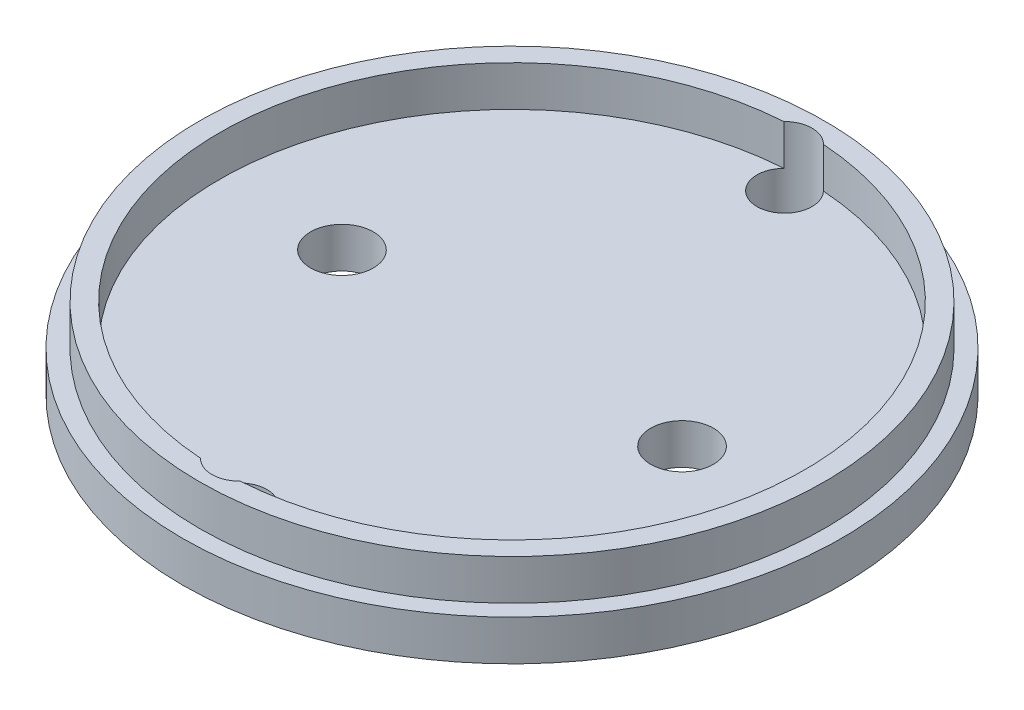
ISO-10303-21;
HEADER;
FILE_DESCRIPTION(('STEP AP214'),'2;1');
FILE_NAME('part.step','',(''),(''),'','','');
FILE_SCHEMA(('AUTOMOTIVE_DESIGN { 1 0 10303 214 1 1 1 1 }'));
ENDSEC;
DATA;
#1=APPLICATION_CONTEXT('core data for automotive mechanical design processes');
#2=APPLICATION_PROTOCOL_DEFINITION('international standard','automotive_design',2000,#1);
#3=PRODUCT_CONTEXT('',#1,'mechanical');
#4=PRODUCT('Part','Part','',(#3));
#5=PRODUCT_RELATED_PRODUCT_CATEGORY('part','',(#4));
#6=PRODUCT_DEFINITION_FORMATION('','',#4);
#7=PRODUCT_DEFINITION_CONTEXT('part definition',#1,'design');
#8=PRODUCT_DEFINITION('design','',#6,#7);
#9=PRODUCT_DEFINITION_SHAPE('','',#8);
#10=(LENGTH_UNIT() NAMED_UNIT(*) SI_UNIT(.MILLI.,.METRE.));
#11=(NAMED_UNIT(*) PLANE_ANGLE_UNIT() SI_UNIT($,.RADIAN.));
#12=(NAMED_UNIT(*) SI_UNIT($,.STERADIAN.) SOLID_ANGLE_UNIT());
#13=UNCERTAINTY_MEASURE_WITH_UNIT(LENGTH_MEASURE(1.E-05),#10,'distance_accuracy_value','');
#14=(GEOMETRIC_REPRESENTATION_CONTEXT(3) GLOBAL_UNCERTAINTY_ASSIGNED_CONTEXT((#13)) GLOBAL_UNIT_ASSIGNED_CONTEXT((#10,
#11,#12)) REPRESENTATION_CONTEXT('',''));
#15=CARTESIAN_POINT('',(0.,0.,0.));
#16=DIRECTION('',(0.,0.,1.));
#17=DIRECTION('',(1.,0.,0.));
#18=AXIS2_PLACEMENT_3D('',#15,#16,#17);
#19=CARTESIAN_POINT('',(0.,5.,0.));
#20=DIRECTION('',(0.,-1.,0.));
#21=DIRECTION('',(0.,0.,-1.));
#22=AXIS2_PLACEMENT_3D('',#19,#20,#21);
#23=CYLINDRICAL_SURFACE('',#22,36.1);
#24=DIRECTION('',(0.,-1.,0.));
#25=VECTOR('',#24,1.);
#26=CARTESIAN_POINT('',(-2.44553108262747,-5.99999999944395E-06,36.0170706432922));
#27=LINE('',#26,#25);
#28=CARTESIAN_POINT('',(-2.44553108262747,0.,36.0170706432922));
#29=VERTEX_POINT('',#28);
#30=CARTESIAN_POINT('',(-2.44553108262747,5.,36.0170706432922));
#31=VERTEX_POINT('',#30);
#32=EDGE_CURVE('E145',#29,#31,#27,.F.);
#33=ORIENTED_EDGE('',*,*,#32,.F.);
#34=CARTESIAN_POINT('',(0.,0.,0.));
#35=DIRECTION('',(0.,1.,0.));
#36=DIRECTION('',(0.,0.,1.));
#37=AXIS2_PLACEMENT_3D('',#34,#35,#36);
#38=CIRCLE('',#37,36.1);
#39=CARTESIAN_POINT('',(-2.44553108262746,0.,-36.0170706432922));
#40=VERTEX_POINT('',#39);
#41=EDGE_CURVE('E126',#40,#29,#38,.T.);
#42=ORIENTED_EDGE('',*,*,#41,.F.);
#43=DIRECTION('',(0.,-1.,0.));
#44=VECTOR('',#43,1.);
#45=CARTESIAN_POINT('',(-2.44553108262746,-5.99999999944395E-06,-36.0170706432922));
#46=LINE('',#45,#44);
#47=CARTESIAN_POINT('',(-2.44553108262746,5.,-36.0170706432922));
#48=VERTEX_POINT('',#47);
#49=EDGE_CURVE('E65',#48,#40,#46,.T.);
#50=ORIENTED_EDGE('',*,*,#49,.F.);
#51=CARTESIAN_POINT('',(0.,5.,0.));
#52=DIRECTION('',(0.,1.,0.));
#53=DIRECTION('',(0.,0.,1.));
#54=AXIS2_PLACEMENT_3D('',#51,#52,#53);
#55=CIRCLE('',#54,36.1);
#56=EDGE_CURVE('E108',#48,#31,#55,.T.);
#57=ORIENTED_EDGE('',*,*,#56,.T.);
#58=EDGE_LOOP('',(#33,#42,#50,#57));
#59=FACE_BOUND('',#58,.T.);
#60=ADVANCED_FACE('F47',(#59),#23,.F.);
#61=DIRECTION('',(0.,-1.,0.));
#62=VECTOR('',#61,1.);
#63=CARTESIAN_POINT('',(2.44553108262745,-5.99999999944395E-06,36.0170706432922));
#64=LINE('',#63,#62);
#65=CARTESIAN_POINT('',(2.44553108262745,5.,36.0170706432922));
#66=VERTEX_POINT('',#65);
#67=CARTESIAN_POINT('',(2.44553108262745,0.,36.0170706432922));
#68=VERTEX_POINT('',#67);
#69=EDGE_CURVE('E72',#66,#68,#64,.T.);
#70=ORIENTED_EDGE('',*,*,#69,.F.);
#71=CARTESIAN_POINT('',(2.44553108262746,5.,-36.0170706432922));
#72=VERTEX_POINT('',#71);
#73=EDGE_CURVE('E106',#66,#72,#55,.T.);
#74=ORIENTED_EDGE('',*,*,#73,.T.);
#75=DIRECTION('',(0.,-1.,0.));
#76=VECTOR('',#75,1.);
#77=CARTESIAN_POINT('',(2.44553108262746,-5.99999999944395E-06,-36.0170706432922));
#78=LINE('',#77,#76);
#79=CARTESIAN_POINT('',(2.44553108262746,0.,-36.0170706432922));
#80=VERTEX_POINT('',#79);
#81=EDGE_CURVE('E88',#80,#72,#78,.F.);
#82=ORIENTED_EDGE('',*,*,#81,.F.);
#83=EDGE_CURVE('E119',#68,#80,#38,.T.);
#84=ORIENTED_EDGE('',*,*,#83,.F.);
#85=EDGE_LOOP('',(#70,#74,#82,#84));
#86=FACE_BOUND('',#85,.T.);
#87=ADVANCED_FACE('F49',(#86),#23,.F.);
#88=CARTESIAN_POINT('',(0.,5.,0.));
#89=DIRECTION('',(0.,-1.,0.));
#90=DIRECTION('',(0.,0.,-1.));
#91=AXIS2_PLACEMENT_3D('',#88,#89,#90);
#92=CYLINDRICAL_SURFACE('',#91,38.6);
#93=CARTESIAN_POINT('',(0.,5.,0.));
#94=DIRECTION('',(0.,1.,0.));
#95=DIRECTION('',(0.,0.,1.));
#96=AXIS2_PLACEMENT_3D('',#93,#94,#95);
#97=CIRCLE('',#96,38.6);
#98=CARTESIAN_POINT('',(0.,5.,38.6));
#99=VERTEX_POINT('',#98);
#100=EDGE_CURVE('E113',#99,#99,#97,.T.);
#101=ORIENTED_EDGE('',*,*,#100,.F.);
#102=EDGE_LOOP('',(#101));
#103=FACE_BOUND('',#102,.T.);
#104=CARTESIAN_POINT('',(0.,0.,0.));
#105=DIRECTION('',(0.,1.,0.));
#106=DIRECTION('',(0.,0.,1.));
#107=AXIS2_PLACEMENT_3D('',#104,#105,#106);
#108=CIRCLE('',#107,38.6);
#109=CARTESIAN_POINT('',(0.,0.,38.6));
#110=VERTEX_POINT('',#109);
#111=EDGE_CURVE('E127',#110,#110,#108,.T.);
#112=ORIENTED_EDGE('',*,*,#111,.T.);
#113=EDGE_LOOP('',(#112));
#114=FACE_BOUND('',#113,.T.);
#115=ADVANCED_FACE('F185',(#103,#114),#92,.T.);
#116=CARTESIAN_POINT('',(0.,5.,0.));
#117=DIRECTION('',(0.,1.,0.));
#118=DIRECTION('',(0.,0.,1.));
#119=AXIS2_PLACEMENT_3D('',#116,#117,#118);
#120=PLANE('',#119);
#121=CARTESIAN_POINT('',(0.,5.,33.655));
#122=DIRECTION('',(0.,-1.,0.));
#123=DIRECTION('',(0.,0.,-1.));
#124=AXIS2_PLACEMENT_3D('',#121,#122,#123);
#125=CIRCLE('',#124,3.4);
#126=EDGE_CURVE('E110',#66,#31,#125,.T.);
#127=ORIENTED_EDGE('',*,*,#126,.T.);
#128=ORIENTED_EDGE('',*,*,#56,.F.);
#129=CARTESIAN_POINT('',(0.,5.,-33.655));
#130=DIRECTION('',(0.,-1.,0.));
#131=DIRECTION('',(0.,0.,-1.));
#132=AXIS2_PLACEMENT_3D('',#129,#130,#131);
#133=CIRCLE('',#132,3.4);
#134=EDGE_CURVE('E92',#48,#72,#133,.T.);
#135=ORIENTED_EDGE('',*,*,#134,.T.);
#136=ORIENTED_EDGE('',*,*,#73,.F.);
#137=EDGE_LOOP('',(#127,#128,#135,#136));
#138=FACE_BOUND('',#137,.T.);
#139=ORIENTED_EDGE('',*,*,#100,.T.);
#140=EDGE_LOOP('',(#139));
#141=FACE_BOUND('',#140,.T.);
#142=ADVANCED_FACE('F104',(#138,#141),#120,.T.);
#143=CARTESIAN_POINT('',(0.,0.,0.));
#144=DIRECTION('',(0.,1.,0.));
#145=DIRECTION('',(0.,0.,1.));
#146=AXIS2_PLACEMENT_3D('',#143,#144,#145);
#147=PLANE('',#146);
#148=ORIENTED_EDGE('',*,*,#111,.F.);
#149=EDGE_LOOP('',(#148));
#150=FACE_BOUND('',#149,.T.);
#151=CARTESIAN_POINT('',(0.,0.,0.));
#152=DIRECTION('',(0.,1.,0.));
#153=DIRECTION('',(0.,0.,1.));
#154=AXIS2_PLACEMENT_3D('',#151,#152,#153);
#155=CIRCLE('',#154,40.7);
#156=CARTESIAN_POINT('',(0.,0.,40.7));
#157=VERTEX_POINT('',#156);
#158=EDGE_CURVE('E121',#157,#157,#155,.T.);
#159=ORIENTED_EDGE('',*,*,#158,.T.);
#160=EDGE_LOOP('',(#159));
#161=FACE_BOUND('',#160,.T.);
#162=ADVANCED_FACE('F164',(#150,#161),#147,.T.);
#163=CARTESIAN_POINT('',(0.,-5.,0.));
#164=DIRECTION('',(0.,1.,0.));
#165=DIRECTION('',(0.,0.,1.));
#166=AXIS2_PLACEMENT_3D('',#163,#164,#165);
#167=PLANE('',#166);
#168=CARTESIAN_POINT('',(-21.,-5.,0.));
#169=DIRECTION('',(0.,1.,0.));
#170=DIRECTION('',(0.,0.,1.));
#171=AXIS2_PLACEMENT_3D('',#168,#169,#170);
#172=CIRCLE('',#171,3.875);
#173=CARTESIAN_POINT('',(-21.,-5.,3.87499999999999));
#174=VERTEX_POINT('',#173);
#175=EDGE_CURVE('E153',#174,#174,#172,.T.);
#176=ORIENTED_EDGE('',*,*,#175,.T.);
#177=EDGE_LOOP('',(#176));
#178=FACE_BOUND('',#177,.T.);
#179=CARTESIAN_POINT('',(21.,-5.,0.));
#180=DIRECTION('',(0.,1.,0.));
#181=DIRECTION('',(0.,0.,1.));
#182=AXIS2_PLACEMENT_3D('',#179,#180,#181);
#183=CIRCLE('',#182,3.875);
#184=CARTESIAN_POINT('',(21.,-5.,3.875));
#185=VERTEX_POINT('',#184);
#186=EDGE_CURVE('E136',#185,#185,#183,.T.);
#187=ORIENTED_EDGE('',*,*,#186,.T.);
#188=EDGE_LOOP('',(#187));
#189=FACE_BOUND('',#188,.T.);
#190=CARTESIAN_POINT('',(0.,-5.,33.655));
#191=DIRECTION('',(0.,1.,0.));
#192=DIRECTION('',(0.,0.,1.));
#193=AXIS2_PLACEMENT_3D('',#190,#191,#192);
#194=CIRCLE('',#193,3.4);
#195=CARTESIAN_POINT('',(0.,-5.,37.055));
#196=VERTEX_POINT('',#195);
#197=EDGE_CURVE('E137',#196,#196,#194,.T.);
#198=ORIENTED_EDGE('',*,*,#197,.T.);
#199=EDGE_LOOP('',(#198));
#200=FACE_BOUND('',#199,.T.);
#201=CARTESIAN_POINT('',(0.,-5.,-33.655));
#202=DIRECTION('',(0.,1.,0.));
#203=DIRECTION('',(0.,0.,1.));
#204=AXIS2_PLACEMENT_3D('',#201,#202,#203);
#205=CIRCLE('',#204,3.4);
#206=CARTESIAN_POINT('',(0.,-5.,-30.255));
#207=VERTEX_POINT('',#206);
#208=EDGE_CURVE('E98',#207,#207,#205,.T.);
#209=ORIENTED_EDGE('',*,*,#208,.T.);
#210=EDGE_LOOP('',(#209));
#211=FACE_BOUND('',#210,.T.);
#212=CARTESIAN_POINT('',(0.,-5.,0.));
#213=DIRECTION('',(0.,1.,0.));
#214=DIRECTION('',(0.,0.,1.));
#215=AXIS2_PLACEMENT_3D('',#212,#213,#214);
#216=CIRCLE('',#215,40.7);
#217=CARTESIAN_POINT('',(0.,-5.,40.7));
#218=VERTEX_POINT('',#217);
#219=EDGE_CURVE('E131',#218,#218,#216,.T.);
#220=ORIENTED_EDGE('',*,*,#219,.F.);
#221=EDGE_LOOP('',(#220));
#222=FACE_BOUND('',#221,.T.);
#223=ADVANCED_FACE('F169',(#178,#189,#200,#211,#222),#167,.F.);
#224=CARTESIAN_POINT('',(0.,-5.,0.));
#225=DIRECTION('',(0.,1.,0.));
#226=DIRECTION('',(0.,0.,1.));
#227=AXIS2_PLACEMENT_3D('',#224,#225,#226);
#228=CYLINDRICAL_SURFACE('',#227,40.7);
#229=ORIENTED_EDGE('',*,*,#219,.T.);
#230=EDGE_LOOP('',(#229));
#231=FACE_BOUND('',#230,.T.);
#232=ORIENTED_EDGE('',*,*,#158,.F.);
#233=EDGE_LOOP('',(#232));
#234=FACE_BOUND('',#233,.T.);
#235=ADVANCED_FACE('F166',(#231,#234),#228,.T.);
#236=CARTESIAN_POINT('',(-21.,0.,0.));
#237=DIRECTION('',(0.,1.,0.));
#238=DIRECTION('',(0.,0.,1.));
#239=AXIS2_PLACEMENT_3D('',#236,#237,#238);
#240=CIRCLE('',#239,3.875);
#241=CARTESIAN_POINT('',(-21.,0.,3.87499999999999));
#242=VERTEX_POINT('',#241);
#243=EDGE_CURVE('E51',#242,#242,#240,.T.);
#244=ORIENTED_EDGE('',*,*,#243,.F.);
#245=EDGE_LOOP('',(#244));
#246=FACE_BOUND('',#245,.T.);
#247=CARTESIAN_POINT('',(21.,0.,0.));
#248=DIRECTION('',(0.,1.,0.));
#249=DIRECTION('',(0.,0.,1.));
#250=AXIS2_PLACEMENT_3D('',#247,#248,#249);
#251=CIRCLE('',#250,3.875);
#252=CARTESIAN_POINT('',(21.,0.,3.875));
#253=VERTEX_POINT('',#252);
#254=EDGE_CURVE('E133',#253,#253,#251,.T.);
#255=ORIENTED_EDGE('',*,*,#254,.F.);
#256=EDGE_LOOP('',(#255));
#257=FACE_BOUND('',#256,.T.);
#258=CARTESIAN_POINT('',(0.,0.,33.655));
#259=DIRECTION('',(0.,1.,0.));
#260=DIRECTION('',(0.,0.,1.));
#261=AXIS2_PLACEMENT_3D('',#258,#259,#260);
#262=CIRCLE('',#261,3.4);
#263=EDGE_CURVE('E11',#68,#29,#262,.T.);
#264=ORIENTED_EDGE('',*,*,#263,.F.);
#265=ORIENTED_EDGE('',*,*,#83,.T.);
#266=CARTESIAN_POINT('',(0.,0.,-33.655));
#267=DIRECTION('',(0.,1.,0.));
#268=DIRECTION('',(0.,0.,1.));
#269=AXIS2_PLACEMENT_3D('',#266,#267,#268);
#270=CIRCLE('',#269,3.4);
#271=EDGE_CURVE('E57',#40,#80,#270,.T.);
#272=ORIENTED_EDGE('',*,*,#271,.F.);
#273=ORIENTED_EDGE('',*,*,#41,.T.);
#274=EDGE_LOOP('',(#264,#265,#272,#273));
#275=FACE_BOUND('',#274,.T.);
#276=ADVANCED_FACE('F168',(#246,#257,#275),#147,.T.);
#277=CARTESIAN_POINT('',(0.,5.,-33.655));
#278=DIRECTION('',(0.,-1.,0.));
#279=DIRECTION('',(0.,0.,-1.));
#280=AXIS2_PLACEMENT_3D('',#277,#278,#279);
#281=CYLINDRICAL_SURFACE('',#280,3.4);
#282=ORIENTED_EDGE('',*,*,#81,.T.);
#283=ORIENTED_EDGE('',*,*,#134,.F.);
#284=ORIENTED_EDGE('',*,*,#49,.T.);
#285=ORIENTED_EDGE('',*,*,#271,.T.);
#286=EDGE_LOOP('',(#282,#283,#284,#285));
#287=FACE_BOUND('',#286,.T.);
#288=ORIENTED_EDGE('',*,*,#208,.F.);
#289=EDGE_LOOP('',(#288));
#290=FACE_BOUND('',#289,.T.);
#291=ADVANCED_FACE('F90',(#287,#290),#281,.F.);
#292=CARTESIAN_POINT('',(0.,5.,33.655));
#293=DIRECTION('',(0.,-1.,0.));
#294=DIRECTION('',(0.,0.,-1.));
#295=AXIS2_PLACEMENT_3D('',#292,#293,#294);
#296=CYLINDRICAL_SURFACE('',#295,3.4);
#297=ORIENTED_EDGE('',*,*,#32,.T.);
#298=ORIENTED_EDGE('',*,*,#126,.F.);
#299=ORIENTED_EDGE('',*,*,#69,.T.);
#300=ORIENTED_EDGE('',*,*,#263,.T.);
#301=EDGE_LOOP('',(#297,#298,#299,#300));
#302=FACE_BOUND('',#301,.T.);
#303=ORIENTED_EDGE('',*,*,#197,.F.);
#304=EDGE_LOOP('',(#303));
#305=FACE_BOUND('',#304,.T.);
#306=ADVANCED_FACE('F191',(#302,#305),#296,.F.);
#307=CARTESIAN_POINT('',(21.,5.,0.));
#308=DIRECTION('',(0.,-1.,0.));
#309=DIRECTION('',(0.,0.,-1.));
#310=AXIS2_PLACEMENT_3D('',#307,#308,#309);
#311=CYLINDRICAL_SURFACE('',#310,3.875);
#312=ORIENTED_EDGE('',*,*,#254,.T.);
#313=EDGE_LOOP('',(#312));
#314=FACE_BOUND('',#313,.T.);
#315=ORIENTED_EDGE('',*,*,#186,.F.);
#316=EDGE_LOOP('',(#315));
#317=FACE_BOUND('',#316,.T.);
#318=ADVANCED_FACE('F194',(#314,#317),#311,.F.);
#319=CARTESIAN_POINT('',(-21.,5.,0.));
#320=DIRECTION('',(0.,-1.,0.));
#321=DIRECTION('',(0.,0.,-1.));
#322=AXIS2_PLACEMENT_3D('',#319,#320,#321);
#323=CYLINDRICAL_SURFACE('',#322,3.875);
#324=ORIENTED_EDGE('',*,*,#243,.T.);
#325=EDGE_LOOP('',(#324));
#326=FACE_BOUND('',#325,.T.);
#327=ORIENTED_EDGE('',*,*,#175,.F.);
#328=EDGE_LOOP('',(#327));
#329=FACE_BOUND('',#328,.T.);
#330=ADVANCED_FACE('F200',(#326,#329),#323,.F.);
#331=CLOSED_SHELL('',(#60,#87,#115,#142,#162,#223,#235,#276,#291,#306,#318,#330));
#332=MANIFOLD_SOLID_BREP('B2',#331);
#333=ADVANCED_BREP_SHAPE_REPRESENTATION('',(#18,#332),#14);
#334=SHAPE_DEFINITION_REPRESENTATION(#9,#333);
ENDSEC;
END-ISO-10303-21;
